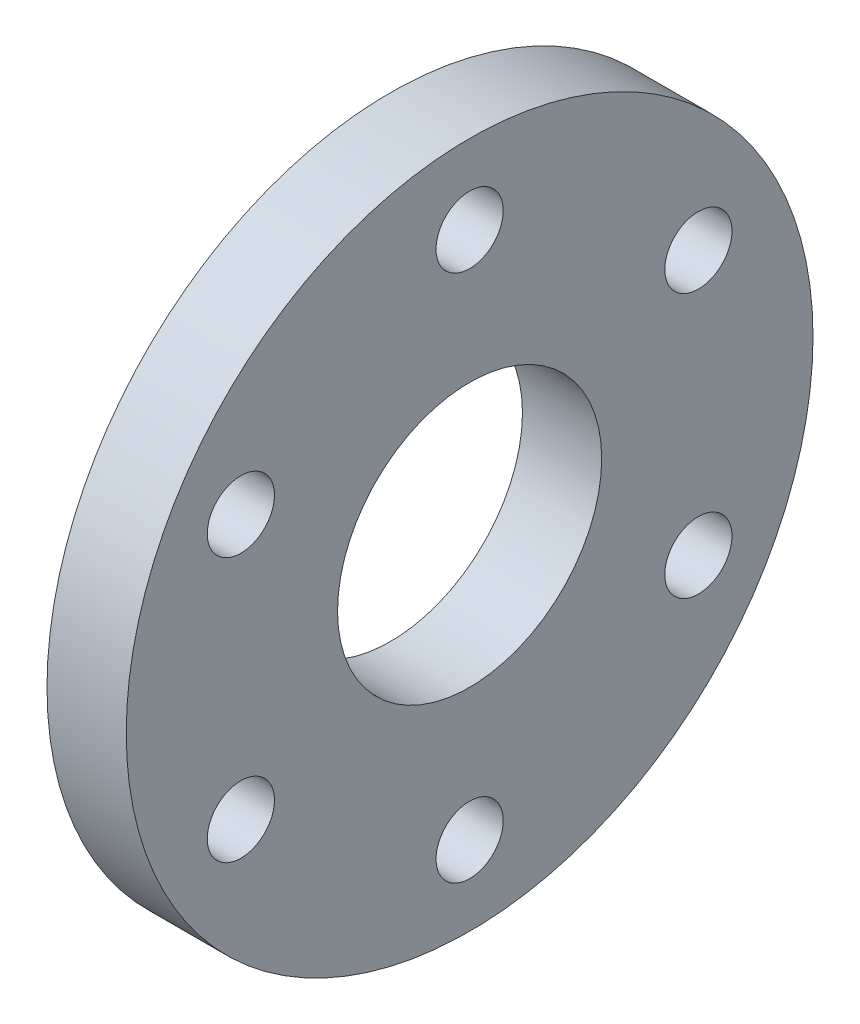
ISO-10303-21;
HEADER;
FILE_DESCRIPTION(('STEP AP214'),'2;1');
FILE_NAME('part.step','',(''),(''),'','','');
FILE_SCHEMA(('AUTOMOTIVE_DESIGN { 1 0 10303 214 1 1 1 1 }'));
ENDSEC;
DATA;
#1=APPLICATION_CONTEXT('core data for automotive mechanical design processes');
#2=APPLICATION_PROTOCOL_DEFINITION('international standard','automotive_design',2000,#1);
#3=PRODUCT_CONTEXT('',#1,'mechanical');
#4=PRODUCT('Part','Part','',(#3));
#5=PRODUCT_RELATED_PRODUCT_CATEGORY('part','',(#4));
#6=PRODUCT_DEFINITION_FORMATION('','',#4);
#7=PRODUCT_DEFINITION_CONTEXT('part definition',#1,'design');
#8=PRODUCT_DEFINITION('design','',#6,#7);
#9=PRODUCT_DEFINITION_SHAPE('','',#8);
#10=(LENGTH_UNIT() NAMED_UNIT(*) SI_UNIT(.MILLI.,.METRE.));
#11=(NAMED_UNIT(*) PLANE_ANGLE_UNIT() SI_UNIT($,.RADIAN.));
#12=(NAMED_UNIT(*) SI_UNIT($,.STERADIAN.) SOLID_ANGLE_UNIT());
#13=UNCERTAINTY_MEASURE_WITH_UNIT(LENGTH_MEASURE(1.E-05),#10,'distance_accuracy_value','');
#14=(GEOMETRIC_REPRESENTATION_CONTEXT(3) GLOBAL_UNCERTAINTY_ASSIGNED_CONTEXT((#13)) GLOBAL_UNIT_ASSIGNED_CONTEXT((#10,
#11,#12)) REPRESENTATION_CONTEXT('',''));
#15=CARTESIAN_POINT('',(0.,0.,0.));
#16=DIRECTION('',(0.,0.,1.));
#17=DIRECTION('',(1.,0.,0.));
#18=AXIS2_PLACEMENT_3D('',#15,#16,#17);
#19=CARTESIAN_POINT('',(-24.3332,0.,0.));
#20=DIRECTION('',(-1.,0.,0.));
#21=DIRECTION('',(0.,0.,1.));
#22=AXIS2_PLACEMENT_3D('',#19,#20,#21);
#23=CYLINDRICAL_SURFACE('',#22,20.6375);
#24=CARTESIAN_POINT('',(-24.3332,0.,0.));
#25=DIRECTION('',(-1.,0.,0.));
#26=DIRECTION('',(0.,0.,1.));
#27=AXIS2_PLACEMENT_3D('',#24,#25,#26);
#28=CIRCLE('',#27,20.6375);
#29=CARTESIAN_POINT('',(-24.3332,0.,20.6375));
#30=VERTEX_POINT('',#29);
#31=EDGE_CURVE('E10',#30,#30,#28,.T.);
#32=CARTESIAN_POINT('',(-29.0957,0.,0.));
#33=DIRECTION('',(-1.,0.,0.));
#34=DIRECTION('',(0.,0.,1.));
#35=AXIS2_PLACEMENT_3D('',#32,#33,#34);
#36=CIRCLE('',#35,20.6375);
#37=CARTESIAN_POINT('',(-29.0957,0.,20.6375));
#38=VERTEX_POINT('',#37);
#39=EDGE_CURVE('E40',#38,#38,#36,.T.);
#40=CARTESIAN_POINT('',(-24.3332,0.,20.6375));
#41=CARTESIAN_POINT('',(-24.382809375,0.,20.6375));
#42=CARTESIAN_POINT('',(-24.43241875,0.,20.6375));
#43=CARTESIAN_POINT('',(-24.5316375,0.,20.6375));
#44=CARTESIAN_POINT('',(-24.581246875,0.,20.6375));
#45=CARTESIAN_POINT('',(-24.680465625,0.,20.6375));
#46=CARTESIAN_POINT('',(-24.730075,0.,20.6375));
#47=CARTESIAN_POINT('',(-24.82929375,0.,20.6375));
#48=CARTESIAN_POINT('',(-24.878903125,0.,20.6375));
#49=CARTESIAN_POINT('',(-24.978121875,0.,20.6375));
#50=CARTESIAN_POINT('',(-25.02773125,0.,20.6375));
#51=CARTESIAN_POINT('',(-25.12695,0.,20.6375));
#52=CARTESIAN_POINT('',(-25.176559375,0.,20.6375));
#53=CARTESIAN_POINT('',(-25.275778125,0.,20.6375));
#54=CARTESIAN_POINT('',(-25.3253875,0.,20.6375));
#55=CARTESIAN_POINT('',(-25.42460625,0.,20.6375));
#56=CARTESIAN_POINT('',(-25.474215625,0.,20.6375));
#57=CARTESIAN_POINT('',(-25.573434375,0.,20.6375));
#58=CARTESIAN_POINT('',(-25.62304375,0.,20.6375));
#59=CARTESIAN_POINT('',(-25.7222625,0.,20.6375));
#60=CARTESIAN_POINT('',(-25.771871875,0.,20.6375));
#61=CARTESIAN_POINT('',(-25.871090625,0.,20.6375));
#62=CARTESIAN_POINT('',(-25.9207,0.,20.6375));
#63=CARTESIAN_POINT('',(-26.01991875,0.,20.6375));
#64=CARTESIAN_POINT('',(-26.069528125,0.,20.6375));
#65=CARTESIAN_POINT('',(-26.168746875,0.,20.6375));
#66=CARTESIAN_POINT('',(-26.21835625,0.,20.6375));
#67=CARTESIAN_POINT('',(-26.317575,0.,20.6375));
#68=CARTESIAN_POINT('',(-26.367184375,0.,20.6375));
#69=CARTESIAN_POINT('',(-26.466403125,0.,20.6375));
#70=CARTESIAN_POINT('',(-26.5160125,0.,20.6375));
#71=CARTESIAN_POINT('',(-26.61523125,0.,20.6375));
#72=CARTESIAN_POINT('',(-26.664840625,0.,20.6375));
#73=CARTESIAN_POINT('',(-26.764059375,0.,20.6375));
#74=CARTESIAN_POINT('',(-26.81366875,0.,20.6375));
#75=CARTESIAN_POINT('',(-26.9128875,0.,20.6375));
#76=CARTESIAN_POINT('',(-26.962496875,0.,20.6375));
#77=CARTESIAN_POINT('',(-27.061715625,0.,20.6375));
#78=CARTESIAN_POINT('',(-27.111325,0.,20.6375));
#79=CARTESIAN_POINT('',(-27.21054375,0.,20.6375));
#80=CARTESIAN_POINT('',(-27.260153125,0.,20.6375));
#81=CARTESIAN_POINT('',(-27.359371875,0.,20.6375));
#82=CARTESIAN_POINT('',(-27.40898125,0.,20.6375));
#83=CARTESIAN_POINT('',(-27.5082,0.,20.6375));
#84=CARTESIAN_POINT('',(-27.557809375,0.,20.6375));
#85=CARTESIAN_POINT('',(-27.657028125,0.,20.6375));
#86=CARTESIAN_POINT('',(-27.7066375,0.,20.6375));
#87=CARTESIAN_POINT('',(-27.80585625,0.,20.6375));
#88=CARTESIAN_POINT('',(-27.855465625,0.,20.6375));
#89=CARTESIAN_POINT('',(-27.954684375,0.,20.6375));
#90=CARTESIAN_POINT('',(-28.00429375,0.,20.6375));
#91=CARTESIAN_POINT('',(-28.1035125,0.,20.6375));
#92=CARTESIAN_POINT('',(-28.153121875,0.,20.6375));
#93=CARTESIAN_POINT('',(-28.252340625,0.,20.6375));
#94=CARTESIAN_POINT('',(-28.30195,0.,20.6375));
#95=CARTESIAN_POINT('',(-28.40116875,0.,20.6375));
#96=CARTESIAN_POINT('',(-28.450778125,0.,20.6375));
#97=CARTESIAN_POINT('',(-28.549996875,0.,20.6375));
#98=CARTESIAN_POINT('',(-28.59960625,0.,20.6375));
#99=CARTESIAN_POINT('',(-28.698825,0.,20.6375));
#100=CARTESIAN_POINT('',(-28.748434375,0.,20.6375));
#101=CARTESIAN_POINT('',(-28.847653125,0.,20.6375));
#102=CARTESIAN_POINT('',(-28.8972625,0.,20.6375));
#103=CARTESIAN_POINT('',(-28.99648125,0.,20.6375));
#104=CARTESIAN_POINT('',(-29.046090625,0.,20.6375));
#105=CARTESIAN_POINT('',(-29.0957,0.,20.6375));
#106=B_SPLINE_CURVE_WITH_KNOTS('',3,(#40,#41,#42,#43,#44,#45,#46,#47,#48,#49,#50,#51,#52,#53,
#54,#55,#56,#57,#58,#59,#60,#61,#62,#63,#64,#65,#66,#67,#68,#69,#70,#71,#72,#73,#74,#75,#76,#77,
#78,#79,#80,#81,#82,#83,#84,#85,#86,#87,#88,#89,#90,#91,#92,#93,#94,#95,#96,#97,#98,#99,#100,
#101,#102,#103,#104,#105),.UNSPECIFIED.,.F.,.F.,(4,2,2,2,2,2,2,2,2,2,2,2,2,2,2,2,2,2,2,2,2,2,2,
2,2,2,2,2,2,2,2,2,4),(0.,0.148828124999997,0.297656249999997,0.446484374999997,
0.595312499999997,0.744140624999997,0.892968749999997,1.041796875,1.190625,1.339453125,
1.48828125,1.637109375,1.7859375,1.934765625,2.08359375,2.232421875,2.38125,2.530078125,
2.67890625,2.827734375,2.9765625,3.125390625,3.27421875,3.423046875,3.571875,3.720703125,
3.86953125,4.018359375,4.1671875,4.316015625,4.46484375,4.613671875,4.7625),.UNSPECIFIED.);
#107=EDGE_CURVE('BSEAM37',#30,#38,#106,.T.);
#108=ORIENTED_EDGE('',*,*,#31,.T.);
#109=ORIENTED_EDGE('',*,*,#39,.F.);
#110=ORIENTED_EDGE('',*,*,#107,.T.);
#111=ORIENTED_EDGE('',*,*,#107,.F.);
#112=EDGE_LOOP('',(#108,#110,#109,#111));
#113=FACE_BOUND('',#112,.T.);
#114=ADVANCED_FACE('F37',(#113),#23,.T.);
#115=CARTESIAN_POINT('',(-24.3332,0.,0.));
#116=DIRECTION('',(-1.,0.,0.));
#117=DIRECTION('',(0.,0.,1.));
#118=AXIS2_PLACEMENT_3D('',#115,#116,#117);
#119=PLANE('',#118);
#120=CARTESIAN_POINT('',(-24.3332,15.875,0.));
#121=DIRECTION('',(-1.,0.,0.));
#122=DIRECTION('',(0.,0.,1.));
#123=AXIS2_PLACEMENT_3D('',#120,#121,#122);
#124=CIRCLE('',#123,2.0193);
#125=CARTESIAN_POINT('',(-24.3332,15.875,2.0193));
#126=VERTEX_POINT('',#125);
#127=EDGE_CURVE('E52',#126,#126,#124,.T.);
#128=ORIENTED_EDGE('',*,*,#127,.T.);
#129=EDGE_LOOP('',(#128));
#130=FACE_BOUND('',#129,.T.);
#131=CARTESIAN_POINT('',(-24.3332,0.,0.));
#132=DIRECTION('',(-1.,0.,0.));
#133=DIRECTION('',(0.,0.,1.));
#134=AXIS2_PLACEMENT_3D('',#131,#132,#133);
#135=CIRCLE('',#134,7.9375);
#136=CARTESIAN_POINT('',(-24.3332,0.,7.9375));
#137=VERTEX_POINT('',#136);
#138=EDGE_CURVE('E47',#137,#137,#135,.T.);
#139=ORIENTED_EDGE('',*,*,#138,.T.);
#140=EDGE_LOOP('',(#139));
#141=FACE_BOUND('',#140,.T.);
#142=ORIENTED_EDGE('',*,*,#31,.F.);
#143=EDGE_LOOP('',(#142));
#144=FACE_BOUND('',#143,.T.);
#145=CARTESIAN_POINT('',(-24.3332,7.93749999999997,-13.748153285078));
#146=DIRECTION('',(-1.,0.,0.));
#147=DIRECTION('',(0.,0.86602540378444,0.499999999999998));
#148=AXIS2_PLACEMENT_3D('',#145,#146,#147);
#149=CIRCLE('',#148,2.0193);
#150=CARTESIAN_POINT('',(-24.3332,9.68626509786189,-12.738503285078));
#151=VERTEX_POINT('',#150);
#152=EDGE_CURVE('E60',#151,#151,#149,.T.);
#153=ORIENTED_EDGE('',*,*,#152,.T.);
#154=EDGE_LOOP('',(#153));
#155=FACE_BOUND('',#154,.T.);
#156=CARTESIAN_POINT('',(-24.3332,-7.93750000000007,-13.7481532850779));
#157=DIRECTION('',(-1.,0.,0.));
#158=DIRECTION('',(0.,0.866025403784436,-0.500000000000004));
#159=AXIS2_PLACEMENT_3D('',#156,#157,#158);
#160=CIRCLE('',#159,2.0193);
#161=CARTESIAN_POINT('',(-24.3332,-6.18873490213815,-14.7578032850779));
#162=VERTEX_POINT('',#161);
#163=EDGE_CURVE('E66',#162,#162,#160,.T.);
#164=ORIENTED_EDGE('',*,*,#163,.T.);
#165=EDGE_LOOP('',(#164));
#166=FACE_BOUND('',#165,.T.);
#167=CARTESIAN_POINT('',(-24.3332,-15.875,0.));
#168=DIRECTION('',(-1.,0.,0.));
#169=DIRECTION('',(0.,0.,-1.));
#170=AXIS2_PLACEMENT_3D('',#167,#168,#169);
#171=CIRCLE('',#170,2.0193);
#172=CARTESIAN_POINT('',(-24.3332,-15.875,-2.0193));
#173=VERTEX_POINT('',#172);
#174=EDGE_CURVE('E80',#173,#173,#171,.T.);
#175=ORIENTED_EDGE('',*,*,#174,.T.);
#176=EDGE_LOOP('',(#175));
#177=FACE_BOUND('',#176,.T.);
#178=CARTESIAN_POINT('',(-24.3332,-7.93749999999987,13.748153285078));
#179=DIRECTION('',(-1.,0.,0.));
#180=DIRECTION('',(0.,-0.866025403784443,-0.499999999999992));
#181=AXIS2_PLACEMENT_3D('',#178,#179,#180);
#182=CIRCLE('',#181,2.0193);
#183=CARTESIAN_POINT('',(-24.3332,-9.6862650978618,12.7385032850781));
#184=VERTEX_POINT('',#183);
#185=EDGE_CURVE('E74',#184,#184,#182,.T.);
#186=ORIENTED_EDGE('',*,*,#185,.T.);
#187=EDGE_LOOP('',(#186));
#188=FACE_BOUND('',#187,.T.);
#189=CARTESIAN_POINT('',(-24.3332,7.93750000000016,13.7481532850779));
#190=DIRECTION('',(-1.,0.,0.));
#191=DIRECTION('',(0.,-0.866025403784433,0.50000000000001));
#192=AXIS2_PLACEMENT_3D('',#189,#190,#191);
#193=CIRCLE('',#192,2.0193);
#194=CARTESIAN_POINT('',(-24.3332,6.18873490213825,14.7578032850779));
#195=VERTEX_POINT('',#194);
#196=EDGE_CURVE('E67',#195,#195,#193,.T.);
#197=ORIENTED_EDGE('',*,*,#196,.T.);
#198=EDGE_LOOP('',(#197));
#199=FACE_BOUND('',#198,.T.);
#200=ADVANCED_FACE('F98',(#130,#141,#144,#155,#166,#177,#188,#199),#119,.F.);
#201=CARTESIAN_POINT('',(-29.0957,0.,0.));
#202=DIRECTION('',(-1.,0.,0.));
#203=DIRECTION('',(0.,0.,1.));
#204=AXIS2_PLACEMENT_3D('',#201,#202,#203);
#205=PLANE('',#204);
#206=CARTESIAN_POINT('',(-29.0957,7.93750000000016,13.7481532850779));
#207=DIRECTION('',(-1.,0.,0.));
#208=DIRECTION('',(0.,-0.866025403784433,0.50000000000001));
#209=AXIS2_PLACEMENT_3D('',#206,#207,#208);
#210=CIRCLE('',#209,2.0193);
#211=CARTESIAN_POINT('',(-29.0957,6.18873490213825,14.7578032850779));
#212=VERTEX_POINT('',#211);
#213=EDGE_CURVE('E71',#212,#212,#210,.T.);
#214=ORIENTED_EDGE('',*,*,#213,.F.);
#215=EDGE_LOOP('',(#214));
#216=FACE_BOUND('',#215,.T.);
#217=CARTESIAN_POINT('',(-29.0957,-7.93749999999987,13.748153285078));
#218=DIRECTION('',(-1.,0.,0.));
#219=DIRECTION('',(0.,-0.866025403784443,-0.499999999999992));
#220=AXIS2_PLACEMENT_3D('',#217,#218,#219);
#221=CIRCLE('',#220,2.0193);
#222=CARTESIAN_POINT('',(-29.0957,-9.6862650978618,12.7385032850781));
#223=VERTEX_POINT('',#222);
#224=EDGE_CURVE('E70',#223,#223,#221,.T.);
#225=ORIENTED_EDGE('',*,*,#224,.F.);
#226=EDGE_LOOP('',(#225));
#227=FACE_BOUND('',#226,.T.);
#228=CARTESIAN_POINT('',(-29.0957,-15.875,0.));
#229=DIRECTION('',(-1.,0.,0.));
#230=DIRECTION('',(0.,0.,-1.));
#231=AXIS2_PLACEMENT_3D('',#228,#229,#230);
#232=CIRCLE('',#231,2.0193);
#233=CARTESIAN_POINT('',(-29.0957,-15.875,-2.0193));
#234=VERTEX_POINT('',#233);
#235=EDGE_CURVE('E77',#234,#234,#232,.T.);
#236=ORIENTED_EDGE('',*,*,#235,.F.);
#237=EDGE_LOOP('',(#236));
#238=FACE_BOUND('',#237,.T.);
#239=CARTESIAN_POINT('',(-29.0957,-7.93750000000007,-13.7481532850779));
#240=DIRECTION('',(-1.,0.,0.));
#241=DIRECTION('',(0.,0.866025403784436,-0.500000000000004));
#242=AXIS2_PLACEMENT_3D('',#239,#240,#241);
#243=CIRCLE('',#242,2.0193);
#244=CARTESIAN_POINT('',(-29.0957,-6.18873490213815,-14.7578032850779));
#245=VERTEX_POINT('',#244);
#246=EDGE_CURVE('E83',#245,#245,#243,.T.);
#247=ORIENTED_EDGE('',*,*,#246,.F.);
#248=EDGE_LOOP('',(#247));
#249=FACE_BOUND('',#248,.T.);
#250=CARTESIAN_POINT('',(-29.0957,7.93749999999997,-13.748153285078));
#251=DIRECTION('',(-1.,0.,0.));
#252=DIRECTION('',(0.,0.86602540378444,0.499999999999998));
#253=AXIS2_PLACEMENT_3D('',#250,#251,#252);
#254=CIRCLE('',#253,2.0193);
#255=CARTESIAN_POINT('',(-29.0957,9.68626509786189,-12.738503285078));
#256=VERTEX_POINT('',#255);
#257=EDGE_CURVE('E63',#256,#256,#254,.T.);
#258=ORIENTED_EDGE('',*,*,#257,.F.);
#259=EDGE_LOOP('',(#258));
#260=FACE_BOUND('',#259,.T.);
#261=CARTESIAN_POINT('',(-29.0957,15.875,0.));
#262=DIRECTION('',(-1.,0.,0.));
#263=DIRECTION('',(0.,0.,1.));
#264=AXIS2_PLACEMENT_3D('',#261,#262,#263);
#265=CIRCLE('',#264,2.0193);
#266=CARTESIAN_POINT('',(-29.0957,15.875,2.0193));
#267=VERTEX_POINT('',#266);
#268=EDGE_CURVE('E57',#267,#267,#265,.T.);
#269=ORIENTED_EDGE('',*,*,#268,.F.);
#270=EDGE_LOOP('',(#269));
#271=FACE_BOUND('',#270,.T.);
#272=CARTESIAN_POINT('',(-29.0957,0.,0.));
#273=DIRECTION('',(-1.,0.,0.));
#274=DIRECTION('',(0.,0.,1.));
#275=AXIS2_PLACEMENT_3D('',#272,#273,#274);
#276=CIRCLE('',#275,7.9375);
#277=CARTESIAN_POINT('',(-29.0957,0.,7.9375));
#278=VERTEX_POINT('',#277);
#279=EDGE_CURVE('E49',#278,#278,#276,.T.);
#280=ORIENTED_EDGE('',*,*,#279,.F.);
#281=EDGE_LOOP('',(#280));
#282=FACE_BOUND('',#281,.T.);
#283=ORIENTED_EDGE('',*,*,#39,.T.);
#284=EDGE_LOOP('',(#283));
#285=FACE_BOUND('',#284,.T.);
#286=ADVANCED_FACE('F94',(#216,#227,#238,#249,#260,#271,#282,#285),#205,.T.);
#287=CARTESIAN_POINT('',(-24.3332,0.,0.));
#288=DIRECTION('',(-1.,0.,0.));
#289=DIRECTION('',(0.,0.,1.));
#290=AXIS2_PLACEMENT_3D('',#287,#288,#289);
#291=CYLINDRICAL_SURFACE('',#290,7.9375);
#292=CARTESIAN_POINT('',(-24.3332,0.,7.9375));
#293=CARTESIAN_POINT('',(-24.382809375,0.,7.9375));
#294=CARTESIAN_POINT('',(-24.43241875,0.,7.9375));
#295=CARTESIAN_POINT('',(-24.5316375,0.,7.9375));
#296=CARTESIAN_POINT('',(-24.581246875,0.,7.9375));
#297=CARTESIAN_POINT('',(-24.680465625,0.,7.9375));
#298=CARTESIAN_POINT('',(-24.730075,0.,7.9375));
#299=CARTESIAN_POINT('',(-24.82929375,0.,7.9375));
#300=CARTESIAN_POINT('',(-24.878903125,0.,7.9375));
#301=CARTESIAN_POINT('',(-24.978121875,0.,7.9375));
#302=CARTESIAN_POINT('',(-25.02773125,0.,7.9375));
#303=CARTESIAN_POINT('',(-25.12695,0.,7.9375));
#304=CARTESIAN_POINT('',(-25.176559375,0.,7.9375));
#305=CARTESIAN_POINT('',(-25.275778125,0.,7.9375));
#306=CARTESIAN_POINT('',(-25.3253875,0.,7.9375));
#307=CARTESIAN_POINT('',(-25.42460625,0.,7.9375));
#308=CARTESIAN_POINT('',(-25.474215625,0.,7.9375));
#309=CARTESIAN_POINT('',(-25.573434375,0.,7.9375));
#310=CARTESIAN_POINT('',(-25.62304375,0.,7.9375));
#311=CARTESIAN_POINT('',(-25.7222625,0.,7.9375));
#312=CARTESIAN_POINT('',(-25.771871875,0.,7.9375));
#313=CARTESIAN_POINT('',(-25.871090625,0.,7.9375));
#314=CARTESIAN_POINT('',(-25.9207,0.,7.9375));
#315=CARTESIAN_POINT('',(-26.01991875,0.,7.9375));
#316=CARTESIAN_POINT('',(-26.069528125,0.,7.9375));
#317=CARTESIAN_POINT('',(-26.168746875,0.,7.9375));
#318=CARTESIAN_POINT('',(-26.21835625,0.,7.9375));
#319=CARTESIAN_POINT('',(-26.317575,0.,7.9375));
#320=CARTESIAN_POINT('',(-26.367184375,0.,7.9375));
#321=CARTESIAN_POINT('',(-26.466403125,0.,7.9375));
#322=CARTESIAN_POINT('',(-26.5160125,0.,7.9375));
#323=CARTESIAN_POINT('',(-26.61523125,0.,7.9375));
#324=CARTESIAN_POINT('',(-26.664840625,0.,7.9375));
#325=CARTESIAN_POINT('',(-26.764059375,0.,7.9375));
#326=CARTESIAN_POINT('',(-26.81366875,0.,7.9375));
#327=CARTESIAN_POINT('',(-26.9128875,0.,7.9375));
#328=CARTESIAN_POINT('',(-26.962496875,0.,7.9375));
#329=CARTESIAN_POINT('',(-27.061715625,0.,7.9375));
#330=CARTESIAN_POINT('',(-27.111325,0.,7.9375));
#331=CARTESIAN_POINT('',(-27.21054375,0.,7.9375));
#332=CARTESIAN_POINT('',(-27.260153125,0.,7.9375));
#333=CARTESIAN_POINT('',(-27.359371875,0.,7.9375));
#334=CARTESIAN_POINT('',(-27.40898125,0.,7.9375));
#335=CARTESIAN_POINT('',(-27.5082,0.,7.9375));
#336=CARTESIAN_POINT('',(-27.557809375,0.,7.9375));
#337=CARTESIAN_POINT('',(-27.657028125,0.,7.9375));
#338=CARTESIAN_POINT('',(-27.7066375,0.,7.9375));
#339=CARTESIAN_POINT('',(-27.80585625,0.,7.9375));
#340=CARTESIAN_POINT('',(-27.855465625,0.,7.9375));
#341=CARTESIAN_POINT('',(-27.954684375,0.,7.9375));
#342=CARTESIAN_POINT('',(-28.00429375,0.,7.9375));
#343=CARTESIAN_POINT('',(-28.1035125,0.,7.9375));
#344=CARTESIAN_POINT('',(-28.153121875,0.,7.9375));
#345=CARTESIAN_POINT('',(-28.252340625,0.,7.9375));
#346=CARTESIAN_POINT('',(-28.30195,0.,7.9375));
#347=CARTESIAN_POINT('',(-28.40116875,0.,7.9375));
#348=CARTESIAN_POINT('',(-28.450778125,0.,7.9375));
#349=CARTESIAN_POINT('',(-28.549996875,0.,7.9375));
#350=CARTESIAN_POINT('',(-28.59960625,0.,7.9375));
#351=CARTESIAN_POINT('',(-28.698825,0.,7.9375));
#352=CARTESIAN_POINT('',(-28.748434375,0.,7.9375));
#353=CARTESIAN_POINT('',(-28.847653125,0.,7.9375));
#354=CARTESIAN_POINT('',(-28.8972625,0.,7.9375));
#355=CARTESIAN_POINT('',(-28.99648125,0.,7.9375));
#356=CARTESIAN_POINT('',(-29.046090625,0.,7.9375));
#357=CARTESIAN_POINT('',(-29.0957,0.,7.9375));
#358=B_SPLINE_CURVE_WITH_KNOTS('',3,(#292,#293,#294,#295,#296,#297,#298,#299,#300,#301,#302,
#303,#304,#305,#306,#307,#308,#309,#310,#311,#312,#313,#314,#315,#316,#317,#318,#319,#320,#321,
#322,#323,#324,#325,#326,#327,#328,#329,#330,#331,#332,#333,#334,#335,#336,#337,#338,#339,#340,
#341,#342,#343,#344,#345,#346,#347,#348,#349,#350,#351,#352,#353,#354,#355,#356,#357),
.UNSPECIFIED.,.F.,.F.,(4,2,2,2,2,2,2,2,2,2,2,2,2,2,2,2,2,2,2,2,2,2,2,2,2,2,2,2,2,2,2,2,4),(0.,
0.148828124999997,0.297656249999997,0.446484374999997,0.595312499999997,0.744140624999997,
0.892968749999997,1.041796875,1.190625,1.339453125,1.48828125,1.637109375,1.7859375,1.934765625,
2.08359375,2.232421875,2.38125,2.530078125,2.67890625,2.827734375,2.9765625,3.125390625,
3.27421875,3.423046875,3.571875,3.720703125,3.86953125,4.018359375,4.1671875,4.316015625,
4.46484375,4.613671875,4.7625),.UNSPECIFIED.);
#359=EDGE_CURVE('BSEAM97',#137,#278,#358,.T.);
#360=ORIENTED_EDGE('',*,*,#138,.F.);
#361=ORIENTED_EDGE('',*,*,#279,.T.);
#362=ORIENTED_EDGE('',*,*,#359,.T.);
#363=ORIENTED_EDGE('',*,*,#359,.F.);
#364=EDGE_LOOP('',(#360,#362,#361,#363));
#365=FACE_BOUND('',#364,.T.);
#366=ADVANCED_FACE('F97',(#365),#291,.F.);
#367=CARTESIAN_POINT('',(13.1318,15.875,0.));
#368=DIRECTION('',(-1.,0.,0.));
#369=DIRECTION('',(0.,0.,1.));
#370=AXIS2_PLACEMENT_3D('',#367,#368,#369);
#371=CYLINDRICAL_SURFACE('',#370,2.0193);
#372=ORIENTED_EDGE('',*,*,#268,.T.);
#373=EDGE_LOOP('',(#372));
#374=FACE_BOUND('',#373,.T.);
#375=ORIENTED_EDGE('',*,*,#127,.F.);
#376=EDGE_LOOP('',(#375));
#377=FACE_BOUND('',#376,.T.);
#378=ADVANCED_FACE('F120',(#374,#377),#371,.F.);
#379=CARTESIAN_POINT('',(13.1318,7.93749999999997,-13.748153285078));
#380=DIRECTION('',(-1.,0.,0.));
#381=DIRECTION('',(0.,0.86602540378444,0.499999999999998));
#382=AXIS2_PLACEMENT_3D('',#379,#380,#381);
#383=CYLINDRICAL_SURFACE('',#382,2.0193);
#384=ORIENTED_EDGE('',*,*,#257,.T.);
#385=EDGE_LOOP('',(#384));
#386=FACE_BOUND('',#385,.T.);
#387=ORIENTED_EDGE('',*,*,#152,.F.);
#388=EDGE_LOOP('',(#387));
#389=FACE_BOUND('',#388,.T.);
#390=ADVANCED_FACE('F124',(#386,#389),#383,.F.);
#391=CARTESIAN_POINT('',(13.1318,-7.93750000000007,-13.7481532850779));
#392=DIRECTION('',(-1.,0.,0.));
#393=DIRECTION('',(0.,0.866025403784436,-0.500000000000004));
#394=AXIS2_PLACEMENT_3D('',#391,#392,#393);
#395=CYLINDRICAL_SURFACE('',#394,2.0193);
#396=ORIENTED_EDGE('',*,*,#246,.T.);
#397=EDGE_LOOP('',(#396));
#398=FACE_BOUND('',#397,.T.);
#399=ORIENTED_EDGE('',*,*,#163,.F.);
#400=EDGE_LOOP('',(#399));
#401=FACE_BOUND('',#400,.T.);
#402=ADVANCED_FACE('F91',(#398,#401),#395,.F.);
#403=CARTESIAN_POINT('',(13.1318,-15.875,0.));
#404=DIRECTION('',(-1.,0.,0.));
#405=DIRECTION('',(0.,0.,-1.));
#406=AXIS2_PLACEMENT_3D('',#403,#404,#405);
#407=CYLINDRICAL_SURFACE('',#406,2.0193);
#408=ORIENTED_EDGE('',*,*,#235,.T.);
#409=EDGE_LOOP('',(#408));
#410=FACE_BOUND('',#409,.T.);
#411=ORIENTED_EDGE('',*,*,#174,.F.);
#412=EDGE_LOOP('',(#411));
#413=FACE_BOUND('',#412,.T.);
#414=ADVANCED_FACE('F136',(#410,#413),#407,.F.);
#415=CARTESIAN_POINT('',(13.1318,-7.93749999999987,13.748153285078));
#416=DIRECTION('',(-1.,0.,0.));
#417=DIRECTION('',(0.,-0.866025403784443,-0.499999999999992));
#418=AXIS2_PLACEMENT_3D('',#415,#416,#417);
#419=CYLINDRICAL_SURFACE('',#418,2.0193);
#420=ORIENTED_EDGE('',*,*,#224,.T.);
#421=EDGE_LOOP('',(#420));
#422=FACE_BOUND('',#421,.T.);
#423=ORIENTED_EDGE('',*,*,#185,.F.);
#424=EDGE_LOOP('',(#423));
#425=FACE_BOUND('',#424,.T.);
#426=ADVANCED_FACE('F132',(#422,#425),#419,.F.);
#427=CARTESIAN_POINT('',(13.1318,7.93750000000016,13.7481532850779));
#428=DIRECTION('',(-1.,0.,0.));
#429=DIRECTION('',(0.,-0.866025403784433,0.50000000000001));
#430=AXIS2_PLACEMENT_3D('',#427,#428,#429);
#431=CYLINDRICAL_SURFACE('',#430,2.0193);
#432=ORIENTED_EDGE('',*,*,#213,.T.);
#433=EDGE_LOOP('',(#432));
#434=FACE_BOUND('',#433,.T.);
#435=ORIENTED_EDGE('',*,*,#196,.F.);
#436=EDGE_LOOP('',(#435));
#437=FACE_BOUND('',#436,.T.);
#438=ADVANCED_FACE('F129',(#434,#437),#431,.F.);
#439=CLOSED_SHELL('',(#114,#200,#286,#366,#378,#390,#402,#414,#426,#438));
#440=MANIFOLD_SOLID_BREP('B2',#439);
#441=ADVANCED_BREP_SHAPE_REPRESENTATION('',(#18,#440),#14);
#442=SHAPE_DEFINITION_REPRESENTATION(#9,#441);
ENDSEC;
END-ISO-10303-21;
